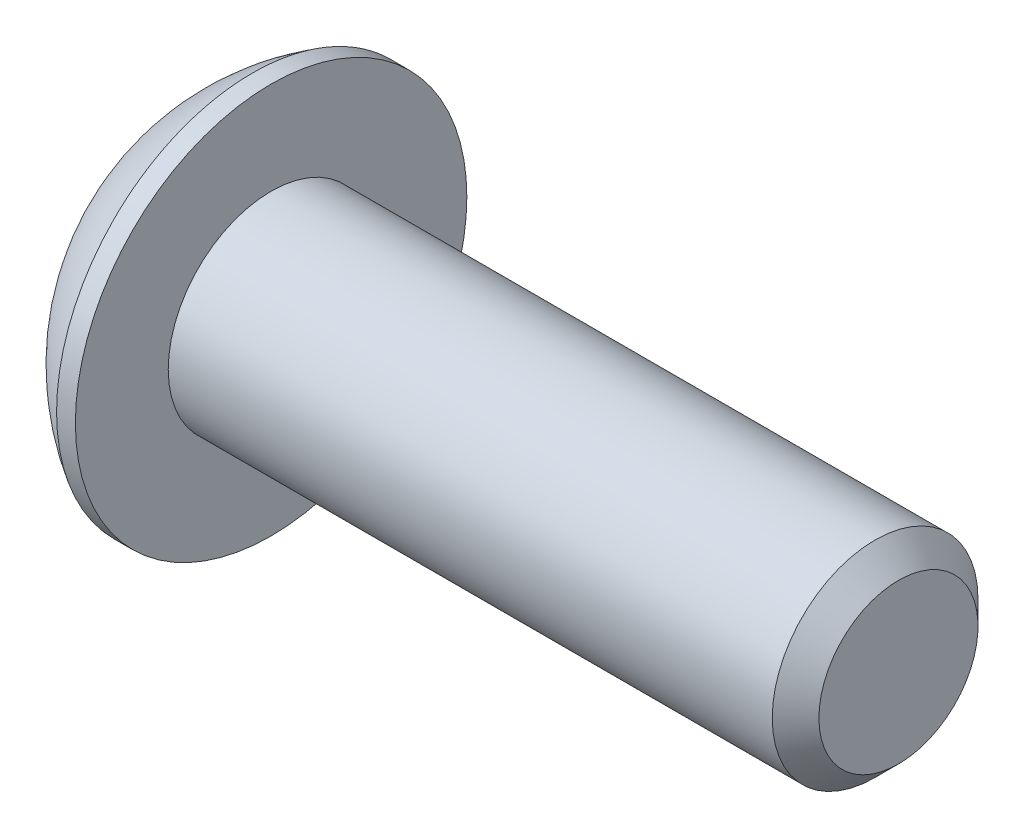
ISO-10303-21;
HEADER;
FILE_DESCRIPTION(('STEP AP214'),'2;1');
FILE_NAME('part.step','',(''),(''),'','','');
FILE_SCHEMA(('AUTOMOTIVE_DESIGN { 1 0 10303 214 1 1 1 1 }'));
ENDSEC;
DATA;
#1=APPLICATION_CONTEXT('core data for automotive mechanical design processes');
#2=APPLICATION_PROTOCOL_DEFINITION('international standard','automotive_design',2000,#1);
#3=PRODUCT_CONTEXT('',#1,'mechanical');
#4=PRODUCT('Part','Part','',(#3));
#5=PRODUCT_RELATED_PRODUCT_CATEGORY('part','',(#4));
#6=PRODUCT_DEFINITION_FORMATION('','',#4);
#7=PRODUCT_DEFINITION_CONTEXT('part definition',#1,'design');
#8=PRODUCT_DEFINITION('design','',#6,#7);
#9=PRODUCT_DEFINITION_SHAPE('','',#8);
#10=(LENGTH_UNIT() NAMED_UNIT(*) SI_UNIT(.MILLI.,.METRE.));
#11=(NAMED_UNIT(*) PLANE_ANGLE_UNIT() SI_UNIT($,.RADIAN.));
#12=(NAMED_UNIT(*) SI_UNIT($,.STERADIAN.) SOLID_ANGLE_UNIT());
#13=UNCERTAINTY_MEASURE_WITH_UNIT(LENGTH_MEASURE(1.E-05),#10,'distance_accuracy_value','');
#14=(GEOMETRIC_REPRESENTATION_CONTEXT(3) GLOBAL_UNCERTAINTY_ASSIGNED_CONTEXT((#13)) GLOBAL_UNIT_ASSIGNED_CONTEXT((#10,
#11,#12)) REPRESENTATION_CONTEXT('',''));
#15=CARTESIAN_POINT('',(0.,0.,0.));
#16=DIRECTION('',(0.,0.,1.));
#17=DIRECTION('',(1.,0.,0.));
#18=AXIS2_PLACEMENT_3D('',#15,#16,#17);
#19=CARTESIAN_POINT('',(1.32080000000034,0.,0.));
#20=DIRECTION('',(-1.,0.,0.));
#21=DIRECTION('',(0.,0.,1.));
#22=AXIS2_PLACEMENT_3D('',#19,#20,#21);
#23=CONICAL_SURFACE('',#22,1.1937999999998,1.04719755119608);
#24=CARTESIAN_POINT('',(2.01004075135902,0.,4.44089209850063E-13));
#25=VERTEX_POINT('',#24);
#26=VERTEX_LOOP('',#25);
#27=FACE_BOUND('',#26,.T.);
#28=CARTESIAN_POINT('',(1.32080000000009,0.,0.));
#29=DIRECTION('',(-1.,0.,0.));
#30=DIRECTION('',(0.,0.,1.));
#31=AXIS2_PLACEMENT_3D('',#28,#29,#30);
#32=CIRCLE('',#31,1.19380000000024);
#33=CARTESIAN_POINT('',(1.32080000000004,-1.03386112703797,0.59690000000006));
#34=VERTEX_POINT('',#33);
#35=CARTESIAN_POINT('',(1.32080000000004,0.,1.19380000000012));
#36=VERTEX_POINT('',#35);
#37=EDGE_CURVE('E18',#34,#36,#32,.T.);
#38=ORIENTED_EDGE('',*,*,#37,.T.);
#39=CARTESIAN_POINT('',(1.32080000000009,0.,0.));
#40=DIRECTION('',(-1.,0.,0.));
#41=DIRECTION('',(0.,0.,1.));
#42=AXIS2_PLACEMENT_3D('',#39,#40,#41);
#43=CIRCLE('',#42,1.19380000000024);
#44=CARTESIAN_POINT('',(1.32080000000004,1.03386112703797,0.596900000000061));
#45=VERTEX_POINT('',#44);
#46=EDGE_CURVE('E146',#36,#45,#43,.T.);
#47=ORIENTED_EDGE('',*,*,#46,.T.);
#48=CARTESIAN_POINT('',(1.32080000000009,0.,0.));
#49=DIRECTION('',(-1.,0.,0.));
#50=DIRECTION('',(0.,0.,1.));
#51=AXIS2_PLACEMENT_3D('',#48,#49,#50);
#52=CIRCLE('',#51,1.19380000000024);
#53=CARTESIAN_POINT('',(1.32080000000004,1.03386112703797,-0.596900000000061));
#54=VERTEX_POINT('',#53);
#55=EDGE_CURVE('E474',#45,#54,#52,.T.);
#56=ORIENTED_EDGE('',*,*,#55,.T.);
#57=CARTESIAN_POINT('',(1.32080000000009,0.,0.));
#58=DIRECTION('',(-1.,0.,0.));
#59=DIRECTION('',(0.,0.,1.));
#60=AXIS2_PLACEMENT_3D('',#57,#58,#59);
#61=CIRCLE('',#60,1.19380000000024);
#62=CARTESIAN_POINT('',(1.32080000000004,1.49457637585666E-12,-1.19380000000012));
#63=VERTEX_POINT('',#62);
#64=EDGE_CURVE('E475',#54,#63,#61,.T.);
#65=ORIENTED_EDGE('',*,*,#64,.T.);
#66=CARTESIAN_POINT('',(1.32080000000009,0.,0.));
#67=DIRECTION('',(-1.,0.,0.));
#68=DIRECTION('',(0.,0.,1.));
#69=AXIS2_PLACEMENT_3D('',#66,#67,#68);
#70=CIRCLE('',#69,1.19380000000024);
#71=CARTESIAN_POINT('',(1.32080000000004,-1.03386112703797,-0.59690000000006));
#72=VERTEX_POINT('',#71);
#73=EDGE_CURVE('E91',#63,#72,#70,.T.);
#74=ORIENTED_EDGE('',*,*,#73,.T.);
#75=CARTESIAN_POINT('',(1.32080000000009,0.,0.));
#76=DIRECTION('',(-1.,0.,0.));
#77=DIRECTION('',(0.,0.,1.));
#78=AXIS2_PLACEMENT_3D('',#75,#76,#77);
#79=CIRCLE('',#78,1.19380000000024);
#80=EDGE_CURVE('E87',#72,#34,#79,.T.);
#81=ORIENTED_EDGE('',*,*,#80,.T.);
#82=EDGE_LOOP('',(#38,#47,#56,#65,#74,#81));
#83=FACE_BOUND('',#82,.T.);
#84=ADVANCED_FACE('F15',(#27,#83),#23,.F.);
#85=CARTESIAN_POINT('',(1.3208,-2.06772225407572,-1.1938));
#86=DIRECTION('',(1.,0.,0.));
#87=DIRECTION('',(0.,0.,-1.));
#88=AXIS2_PLACEMENT_3D('',#85,#86,#87);
#89=PLANE('',#88);
#90=DIRECTION('',(0.,0.5,0.866025403784439));
#91=VECTOR('',#90,1.);
#92=CARTESIAN_POINT('',(1.3208,-1.37848150271715,0.));
#93=LINE('',#92,#91);
#94=CARTESIAN_POINT('',(1.3208,-0.689240751358574,1.1938));
#95=VERTEX_POINT('',#94);
#96=EDGE_CURVE('E99',#95,#34,#93,.F.);
#97=ORIENTED_EDGE('',*,*,#96,.F.);
#98=DIRECTION('',(0.,1.,0.));
#99=VECTOR('',#98,1.);
#100=CARTESIAN_POINT('',(1.3208,-0.689240751358574,1.1938));
#101=LINE('',#100,#99);
#102=EDGE_CURVE('E101',#36,#95,#101,.F.);
#103=ORIENTED_EDGE('',*,*,#102,.F.);
#104=ORIENTED_EDGE('',*,*,#37,.F.);
#105=EDGE_LOOP('',(#97,#103,#104));
#106=FACE_BOUND('',#105,.T.);
#107=ADVANCED_FACE('F97',(#106),#89,.F.);
#108=CARTESIAN_POINT('',(1.3208,-2.06772225407572,-1.1938));
#109=DIRECTION('',(1.,0.,0.));
#110=DIRECTION('',(0.,0.,-1.));
#111=AXIS2_PLACEMENT_3D('',#108,#109,#110);
#112=PLANE('',#111);
#113=DIRECTION('',(0.,-0.5,0.866025403784439));
#114=VECTOR('',#113,1.);
#115=CARTESIAN_POINT('',(1.3208,-0.689240751358574,-1.1938));
#116=LINE('',#115,#114);
#117=CARTESIAN_POINT('',(1.3208,-1.37848150271715,0.));
#118=VERTEX_POINT('',#117);
#119=EDGE_CURVE('E107',#118,#72,#116,.F.);
#120=ORIENTED_EDGE('',*,*,#119,.F.);
#121=DIRECTION('',(0.,0.5,0.866025403784439));
#122=VECTOR('',#121,1.);
#123=CARTESIAN_POINT('',(1.3208,-1.37848150271715,0.));
#124=LINE('',#123,#122);
#125=EDGE_CURVE('E104',#34,#118,#124,.F.);
#126=ORIENTED_EDGE('',*,*,#125,.F.);
#127=ORIENTED_EDGE('',*,*,#80,.F.);
#128=EDGE_LOOP('',(#120,#126,#127));
#129=FACE_BOUND('',#128,.T.);
#130=ADVANCED_FACE('F105',(#129),#112,.F.);
#131=CARTESIAN_POINT('',(1.3208,-2.06772225407572,-1.1938));
#132=DIRECTION('',(1.,0.,0.));
#133=DIRECTION('',(0.,0.,-1.));
#134=AXIS2_PLACEMENT_3D('',#131,#132,#133);
#135=PLANE('',#134);
#136=DIRECTION('',(0.,1.,0.));
#137=VECTOR('',#136,1.);
#138=CARTESIAN_POINT('',(1.3208,0.689240751358577,-1.1938));
#139=LINE('',#138,#137);
#140=CARTESIAN_POINT('',(1.3208,-0.689240751358574,-1.1938));
#141=VERTEX_POINT('',#140);
#142=EDGE_CURVE('E445',#141,#63,#139,.T.);
#143=ORIENTED_EDGE('',*,*,#142,.F.);
#144=DIRECTION('',(0.,-0.5,0.866025403784439));
#145=VECTOR('',#144,1.);
#146=CARTESIAN_POINT('',(1.3208,-0.689240751358574,-1.1938));
#147=LINE('',#146,#145);
#148=EDGE_CURVE('E457',#72,#141,#147,.F.);
#149=ORIENTED_EDGE('',*,*,#148,.F.);
#150=ORIENTED_EDGE('',*,*,#73,.F.);
#151=EDGE_LOOP('',(#143,#149,#150));
#152=FACE_BOUND('',#151,.T.);
#153=ADVANCED_FACE('F189',(#152),#135,.F.);
#154=CARTESIAN_POINT('',(1.3208,-2.06772225407572,-1.1938));
#155=DIRECTION('',(1.,0.,0.));
#156=DIRECTION('',(0.,0.,-1.));
#157=AXIS2_PLACEMENT_3D('',#154,#155,#156);
#158=PLANE('',#157);
#159=DIRECTION('',(0.,-0.5,-0.866025403784439));
#160=VECTOR('',#159,1.);
#161=CARTESIAN_POINT('',(1.3208,1.37848150271715,0.));
#162=LINE('',#161,#160);
#163=CARTESIAN_POINT('',(1.3208,0.689240751358577,-1.1938));
#164=VERTEX_POINT('',#163);
#165=EDGE_CURVE('E431',#164,#54,#162,.F.);
#166=ORIENTED_EDGE('',*,*,#165,.F.);
#167=DIRECTION('',(0.,1.,0.));
#168=VECTOR('',#167,1.);
#169=CARTESIAN_POINT('',(1.3208,0.689240751358577,-1.1938));
#170=LINE('',#169,#168);
#171=EDGE_CURVE('E442',#63,#164,#170,.T.);
#172=ORIENTED_EDGE('',*,*,#171,.F.);
#173=ORIENTED_EDGE('',*,*,#64,.F.);
#174=EDGE_LOOP('',(#166,#172,#173));
#175=FACE_BOUND('',#174,.T.);
#176=ADVANCED_FACE('F185',(#175),#158,.F.);
#177=CARTESIAN_POINT('',(1.3208,-2.06772225407572,-1.1938));
#178=DIRECTION('',(1.,0.,0.));
#179=DIRECTION('',(0.,0.,-1.));
#180=AXIS2_PLACEMENT_3D('',#177,#178,#179);
#181=PLANE('',#180);
#182=DIRECTION('',(0.,0.5,-0.866025403784439));
#183=VECTOR('',#182,1.);
#184=CARTESIAN_POINT('',(1.3208,0.689240751358576,1.1938));
#185=LINE('',#184,#183);
#186=CARTESIAN_POINT('',(1.3208,1.37848150271715,0.));
#187=VERTEX_POINT('',#186);
#188=EDGE_CURVE('E410',#187,#45,#185,.F.);
#189=ORIENTED_EDGE('',*,*,#188,.F.);
#190=DIRECTION('',(0.,-0.5,-0.866025403784439));
#191=VECTOR('',#190,1.);
#192=CARTESIAN_POINT('',(1.3208,1.37848150271715,0.));
#193=LINE('',#192,#191);
#194=EDGE_CURVE('E429',#54,#187,#193,.F.);
#195=ORIENTED_EDGE('',*,*,#194,.F.);
#196=ORIENTED_EDGE('',*,*,#55,.F.);
#197=EDGE_LOOP('',(#189,#195,#196));
#198=FACE_BOUND('',#197,.T.);
#199=ADVANCED_FACE('F181',(#198),#181,.F.);
#200=CARTESIAN_POINT('',(1.3208,-2.06772225407572,-1.1938));
#201=DIRECTION('',(1.,0.,0.));
#202=DIRECTION('',(0.,0.,-1.));
#203=AXIS2_PLACEMENT_3D('',#200,#201,#202);
#204=PLANE('',#203);
#205=DIRECTION('',(0.,1.,0.));
#206=VECTOR('',#205,1.);
#207=CARTESIAN_POINT('',(1.3208,-0.689240751358574,1.1938));
#208=LINE('',#207,#206);
#209=CARTESIAN_POINT('',(1.3208,0.689240751358576,1.1938));
#210=VERTEX_POINT('',#209);
#211=EDGE_CURVE('E116',#210,#36,#208,.F.);
#212=ORIENTED_EDGE('',*,*,#211,.F.);
#213=DIRECTION('',(0.,0.5,-0.866025403784439));
#214=VECTOR('',#213,1.);
#215=CARTESIAN_POINT('',(1.3208,0.689240751358576,1.1938));
#216=LINE('',#215,#214);
#217=EDGE_CURVE('E413',#45,#210,#216,.F.);
#218=ORIENTED_EDGE('',*,*,#217,.F.);
#219=ORIENTED_EDGE('',*,*,#46,.F.);
#220=EDGE_LOOP('',(#212,#218,#219));
#221=FACE_BOUND('',#220,.T.);
#222=ADVANCED_FACE('F177',(#221),#204,.F.);
#223=CARTESIAN_POINT('',(1.3208,-0.689240751358574,1.1938));
#224=DIRECTION('',(0.,0.,-1.));
#225=DIRECTION('',(0.,1.,0.));
#226=AXIS2_PLACEMENT_3D('',#223,#224,#225);
#227=PLANE('',#226);
#228=DIRECTION('',(0.,1.,0.));
#229=VECTOR('',#228,1.);
#230=CARTESIAN_POINT('',(0.,0.,1.1938));
#231=LINE('',#230,#229);
#232=CARTESIAN_POINT('',(0.,0.689240751358577,1.1938));
#233=VERTEX_POINT('',#232);
#234=CARTESIAN_POINT('',(0.,-0.689240751358574,1.1938));
#235=VERTEX_POINT('',#234);
#236=EDGE_CURVE('E407',#233,#235,#231,.F.);
#237=ORIENTED_EDGE('',*,*,#236,.F.);
#238=DIRECTION('',(1.,0.,0.));
#239=VECTOR('',#238,1.);
#240=CARTESIAN_POINT('',(1.3208,0.689240751358576,1.1938));
#241=LINE('',#240,#239);
#242=EDGE_CURVE('E419',#210,#233,#241,.F.);
#243=ORIENTED_EDGE('',*,*,#242,.F.);
#244=ORIENTED_EDGE('',*,*,#211,.T.);
#245=ORIENTED_EDGE('',*,*,#102,.T.);
#246=DIRECTION('',(1.,0.,0.));
#247=VECTOR('',#246,1.);
#248=CARTESIAN_POINT('',(1.3208,-0.689240751358574,1.1938));
#249=LINE('',#248,#247);
#250=EDGE_CURVE('E110',#235,#95,#249,.T.);
#251=ORIENTED_EDGE('',*,*,#250,.F.);
#252=EDGE_LOOP('',(#237,#243,#244,#245,#251));
#253=FACE_BOUND('',#252,.T.);
#254=ADVANCED_FACE('F174',(#253),#227,.T.);
#255=CARTESIAN_POINT('',(1.3208,-1.37848150271715,0.));
#256=DIRECTION('',(0.,0.866025403784439,-0.5));
#257=DIRECTION('',(0.,0.5,0.866025403784439));
#258=AXIS2_PLACEMENT_3D('',#255,#256,#257);
#259=PLANE('',#258);
#260=DIRECTION('',(0.,-0.5,-0.866025403784439));
#261=VECTOR('',#260,1.);
#262=CARTESIAN_POINT('',(0.,-0.689240751358574,1.1938));
#263=LINE('',#262,#261);
#264=CARTESIAN_POINT('',(0.,-1.37848150271715,0.));
#265=VERTEX_POINT('',#264);
#266=EDGE_CURVE('E404',#235,#265,#263,.T.);
#267=ORIENTED_EDGE('',*,*,#266,.F.);
#268=ORIENTED_EDGE('',*,*,#250,.T.);
#269=ORIENTED_EDGE('',*,*,#96,.T.);
#270=ORIENTED_EDGE('',*,*,#125,.T.);
#271=DIRECTION('',(1.,0.,0.));
#272=VECTOR('',#271,1.);
#273=CARTESIAN_POINT('',(1.3208,-1.37848150271715,0.));
#274=LINE('',#273,#272);
#275=EDGE_CURVE('E454',#265,#118,#274,.T.);
#276=ORIENTED_EDGE('',*,*,#275,.F.);
#277=EDGE_LOOP('',(#267,#268,#269,#270,#276));
#278=FACE_BOUND('',#277,.T.);
#279=ADVANCED_FACE('F114',(#278),#259,.T.);
#280=CARTESIAN_POINT('',(1.3208,-0.689240751358574,-1.1938));
#281=DIRECTION('',(0.,0.866025403784439,0.5));
#282=DIRECTION('',(0.,-0.5,0.866025403784439));
#283=AXIS2_PLACEMENT_3D('',#280,#281,#282);
#284=PLANE('',#283);
#285=DIRECTION('',(0.,0.5,-0.866025403784439));
#286=VECTOR('',#285,1.);
#287=CARTESIAN_POINT('',(0.,-1.37848150271715,0.));
#288=LINE('',#287,#286);
#289=CARTESIAN_POINT('',(0.,-0.689240751358574,-1.1938));
#290=VERTEX_POINT('',#289);
#291=EDGE_CURVE('E401',#265,#290,#288,.T.);
#292=ORIENTED_EDGE('',*,*,#291,.F.);
#293=ORIENTED_EDGE('',*,*,#275,.T.);
#294=ORIENTED_EDGE('',*,*,#119,.T.);
#295=ORIENTED_EDGE('',*,*,#148,.T.);
#296=DIRECTION('',(1.,0.,0.));
#297=VECTOR('',#296,1.);
#298=CARTESIAN_POINT('',(1.3208,-0.689240751358574,-1.1938));
#299=LINE('',#298,#297);
#300=EDGE_CURVE('E439',#290,#141,#299,.T.);
#301=ORIENTED_EDGE('',*,*,#300,.F.);
#302=EDGE_LOOP('',(#292,#293,#294,#295,#301));
#303=FACE_BOUND('',#302,.T.);
#304=ADVANCED_FACE('F167',(#303),#284,.T.);
#305=CARTESIAN_POINT('',(1.3208,0.689240751358577,-1.1938));
#306=DIRECTION('',(0.,0.,1.));
#307=DIRECTION('',(1.,0.,0.));
#308=AXIS2_PLACEMENT_3D('',#305,#306,#307);
#309=PLANE('',#308);
#310=DIRECTION('',(0.,1.,0.));
#311=VECTOR('',#310,1.);
#312=CARTESIAN_POINT('',(0.,0.,-1.1938));
#313=LINE('',#312,#311);
#314=CARTESIAN_POINT('',(0.,0.689240751358577,-1.1938));
#315=VERTEX_POINT('',#314);
#316=EDGE_CURVE('E398',#290,#315,#313,.T.);
#317=ORIENTED_EDGE('',*,*,#316,.F.);
#318=ORIENTED_EDGE('',*,*,#300,.T.);
#319=ORIENTED_EDGE('',*,*,#142,.T.);
#320=ORIENTED_EDGE('',*,*,#171,.T.);
#321=DIRECTION('',(1.,0.,0.));
#322=VECTOR('',#321,1.);
#323=CARTESIAN_POINT('',(1.3208,0.689240751358577,-1.1938));
#324=LINE('',#323,#322);
#325=EDGE_CURVE('E414',#315,#164,#324,.T.);
#326=ORIENTED_EDGE('',*,*,#325,.F.);
#327=EDGE_LOOP('',(#317,#318,#319,#320,#326));
#328=FACE_BOUND('',#327,.T.);
#329=ADVANCED_FACE('F164',(#328),#309,.T.);
#330=CARTESIAN_POINT('',(1.3208,1.37848150271715,0.));
#331=DIRECTION('',(0.,-0.866025403784439,0.5));
#332=DIRECTION('',(0.,-0.5,-0.866025403784439));
#333=AXIS2_PLACEMENT_3D('',#330,#331,#332);
#334=PLANE('',#333);
#335=DIRECTION('',(0.,0.5,0.866025403784439));
#336=VECTOR('',#335,1.);
#337=CARTESIAN_POINT('',(0.,0.689240751358577,-1.1938));
#338=LINE('',#337,#336);
#339=CARTESIAN_POINT('',(0.,1.37848150271715,0.));
#340=VERTEX_POINT('',#339);
#341=EDGE_CURVE('E395',#315,#340,#338,.T.);
#342=ORIENTED_EDGE('',*,*,#341,.F.);
#343=ORIENTED_EDGE('',*,*,#325,.T.);
#344=ORIENTED_EDGE('',*,*,#165,.T.);
#345=ORIENTED_EDGE('',*,*,#194,.T.);
#346=DIRECTION('',(1.,0.,0.));
#347=VECTOR('',#346,1.);
#348=CARTESIAN_POINT('',(1.3208,1.37848150271715,0.));
#349=LINE('',#348,#347);
#350=EDGE_CURVE('E33',#340,#187,#349,.T.);
#351=ORIENTED_EDGE('',*,*,#350,.F.);
#352=EDGE_LOOP('',(#342,#343,#344,#345,#351));
#353=FACE_BOUND('',#352,.T.);
#354=ADVANCED_FACE('F160',(#353),#334,.T.);
#355=CARTESIAN_POINT('',(1.3208,0.689240751358576,1.1938));
#356=DIRECTION('',(0.,-0.866025403784439,-0.5));
#357=DIRECTION('',(0.,0.5,-0.866025403784439));
#358=AXIS2_PLACEMENT_3D('',#355,#356,#357);
#359=PLANE('',#358);
#360=DIRECTION('',(0.,-0.5,0.866025403784439));
#361=VECTOR('',#360,1.);
#362=CARTESIAN_POINT('',(0.,1.37848150271715,0.));
#363=LINE('',#362,#361);
#364=EDGE_CURVE('E145',#340,#233,#363,.T.);
#365=ORIENTED_EDGE('',*,*,#364,.F.);
#366=ORIENTED_EDGE('',*,*,#350,.T.);
#367=ORIENTED_EDGE('',*,*,#188,.T.);
#368=ORIENTED_EDGE('',*,*,#217,.T.);
#369=ORIENTED_EDGE('',*,*,#242,.T.);
#370=EDGE_LOOP('',(#365,#366,#367,#368,#369));
#371=FACE_BOUND('',#370,.T.);
#372=ADVANCED_FACE('F156',(#371),#359,.T.);
#373=CARTESIAN_POINT('',(0.,0.,0.));
#374=DIRECTION('',(-1.,0.,0.));
#375=DIRECTION('',(0.,0.,1.));
#376=AXIS2_PLACEMENT_3D('',#373,#374,#375);
#377=PLANE('',#376);
#378=ORIENTED_EDGE('',*,*,#341,.T.);
#379=ORIENTED_EDGE('',*,*,#364,.T.);
#380=ORIENTED_EDGE('',*,*,#236,.T.);
#381=ORIENTED_EDGE('',*,*,#266,.T.);
#382=ORIENTED_EDGE('',*,*,#291,.T.);
#383=ORIENTED_EDGE('',*,*,#316,.T.);
#384=EDGE_LOOP('',(#378,#379,#380,#381,#382,#383));
#385=FACE_BOUND('',#384,.T.);
#386=CARTESIAN_POINT('',(0.,1.9812,0.));
#387=CARTESIAN_POINT('',(0.,1.9811996664299,0.0556258831179428));
#388=CARTESIAN_POINT('',(0.,1.97885520380442,0.111261989398606));
#389=CARTESIAN_POINT('',(0.,1.96949260169541,0.222149719830458));
#390=CARTESIAN_POINT('',(0.,1.96247308239605,0.277401225602895));
#391=CARTESIAN_POINT('',(0.,1.94379192841038,0.387209508139747));
#392=CARTESIAN_POINT('',(-1.85325793235264E-13,1.93212292489526,0.441765039546365));
#393=CARTESIAN_POINT('',(1.86344214223505E-13,1.90422331175315,0.549729449347493));
#394=CARTESIAN_POINT('',(6.94543371897454E-13,1.88798900035338,0.603137359208869));
#395=CARTESIAN_POINT('',(1.15501975216981E-12,1.83266214476501,0.760839131321828));
#396=CARTESIAN_POINT('',(0.,1.78690023648845,0.862876433575429));
#397=CARTESIAN_POINT('',(0.,1.67887358150667,1.05780719540872));
#398=CARTESIAN_POINT('',(9.54193214892627E-13,1.6166082074585,1.15070030720801));
#399=CARTESIAN_POINT('',(5.94805591894675E-13,1.51224157140982,1.28116890915697));
#400=CARTESIAN_POINT('',(1.63221293851378E-13,1.4755970394354,1.32320451127026));
#401=CARTESIAN_POINT('',(-1.62196980336157E-13,1.39893832619713,1.40400288695709));
#402=CARTESIAN_POINT('',(0.,1.35892742784698,1.44276877695455));
#403=CARTESIAN_POINT('',(1.14362537325405E-13,1.23416504602197,1.55382272417904));
#404=CARTESIAN_POINT('',(0.,1.14466125559859,1.62089527952111));
#405=CARTESIAN_POINT('',(0.,0.955712144178167,1.7390221808118));
#406=CARTESIAN_POINT('',(0.,0.856267198233564,1.79007713076007));
#407=CARTESIAN_POINT('',(0.,0.650206345910843,1.87477637530954));
#408=CARTESIAN_POINT('',(0.,0.543590516134855,1.90842085586267));
#409=CARTESIAN_POINT('',(0.,0.326226155292018,1.95733039300656));
#410=CARTESIAN_POINT('',(0.,0.21547760215793,1.97259535144288));
#411=CARTESIAN_POINT('',(0.,-0.00701040587544639,1.98431697865418));
#412=CARTESIAN_POINT('',(0.,-0.118749860774734,1.98077364742917));
#413=CARTESIAN_POINT('',(0.,-0.340050178355485,1.95497485623825));
#414=CARTESIAN_POINT('',(0.,-0.449611052668255,1.93271949620218));
#415=CARTESIAN_POINT('',(0.,-0.663431110729174,1.87014138774523));
#416=CARTESIAN_POINT('',(0.,-0.76769023783852,1.82981844635272));
#417=CARTESIAN_POINT('',(0.,-0.968005760719347,1.73219968377096));
#418=CARTESIAN_POINT('',(0.,-1.0640618469811,1.6749032225164));
#419=CARTESIAN_POINT('',(0.,-1.19980276751283,1.57757371205873));
#420=CARTESIAN_POINT('',(0.,-1.24366557129213,1.54322665019466));
#421=CARTESIAN_POINT('',(0.,-1.32838995706696,1.47093063174264));
#422=CARTESIAN_POINT('',(0.,-1.36924860178706,1.43297823102439));
#423=CARTESIAN_POINT('',(0.,-1.48674671849223,1.31419842051173));
#424=CARTESIAN_POINT('',(0.,-1.55842832343237,1.22836221289311));
#425=CARTESIAN_POINT('',(0.,-1.6863396856475,1.04586168272493));
#426=CARTESIAN_POINT('',(0.,-1.7425700302488,0.949197771949774));
#427=CARTESIAN_POINT('',(0.,-1.8141614250401,0.798182600298684));
#428=CARTESIAN_POINT('',(0.,-1.83591780585875,0.746776203847791));
#429=CARTESIAN_POINT('',(0.,-1.87500754181092,0.642341081688636));
#430=CARTESIAN_POINT('',(0.,-1.89234447645404,0.589313708122847));
#431=CARTESIAN_POINT('',(0.,-1.92246053433554,0.482076273028395));
#432=CARTESIAN_POINT('',(0.,-1.93524685475118,0.42786822425751));
#433=CARTESIAN_POINT('',(0.,-1.95620937250494,0.318578151844611));
#434=CARTESIAN_POINT('',(0.,-1.96438692958147,0.263496390912872));
#435=CARTESIAN_POINT('',(0.,-1.97388528284653,0.173607715038558));
#436=CARTESIAN_POINT('',(0.,-1.97662743364426,0.138944718024998));
#437=CARTESIAN_POINT('',(0.,-1.98028489645283,0.0695224782567002));
#438=CARTESIAN_POINT('',(0.,-1.98120020846367,0.0347632355019631));
#439=CARTESIAN_POINT('',(0.,-1.9811996664299,-0.0556258831179437));
#440=CARTESIAN_POINT('',(0.,-1.97885520380442,-0.111261989398607));
#441=CARTESIAN_POINT('',(0.,-1.96949260169541,-0.222149719830459));
#442=CARTESIAN_POINT('',(0.,-1.96247308239605,-0.277401225602897));
#443=CARTESIAN_POINT('',(0.,-1.94379192841039,-0.387209508139749));
#444=CARTESIAN_POINT('',(-1.85269749640691E-13,-1.93212292489526,-0.441765039546367));
#445=CARTESIAN_POINT('',(1.86288125054388E-13,-1.90422331175315,-0.549729449347495));
#446=CARTESIAN_POINT('',(6.94525090263764E-13,-1.88798900035338,-0.603137359208872));
#447=CARTESIAN_POINT('',(1.15505622829081E-12,-1.83266214476501,-0.760839131321831));
#448=CARTESIAN_POINT('',(0.,-1.78690023648845,-0.862876433575431));
#449=CARTESIAN_POINT('',(0.,-1.67887358150667,-1.05780719540872));
#450=CARTESIAN_POINT('',(9.54248812869379E-13,-1.6166082074585,-1.15070030720801));
#451=CARTESIAN_POINT('',(5.94777756479239E-13,-1.51224157140982,-1.28116890915698));
#452=CARTESIAN_POINT('',(1.63138949183833E-13,-1.47559703943539,-1.32320451127027));
#453=CARTESIAN_POINT('',(-1.62114715061273E-13,-1.39893832619713,-1.40400288695709));
#454=CARTESIAN_POINT('',(0.,-1.35892742784699,-1.44276877695455));
#455=CARTESIAN_POINT('',(1.13760489124207E-13,-1.23416504602197,-1.55382272417904));
#456=CARTESIAN_POINT('',(0.,-1.14466125559859,-1.62089527952111));
#457=CARTESIAN_POINT('',(0.,-0.95571214417816,-1.73902218081179));
#458=CARTESIAN_POINT('',(0.,-0.856267198233559,-1.79007713076007));
#459=CARTESIAN_POINT('',(0.,-0.650206345910841,-1.87477637530954));
#460=CARTESIAN_POINT('',(0.,-0.543590516134854,-1.90842085586267));
#461=CARTESIAN_POINT('',(0.,-0.326226155292018,-1.95733039300657));
#462=CARTESIAN_POINT('',(0.,-0.215477602157929,-1.97259535144288));
#463=CARTESIAN_POINT('',(0.,0.0070104058754487,-1.98431697865418));
#464=CARTESIAN_POINT('',(0.,0.118749860774737,-1.98077364742916));
#465=CARTESIAN_POINT('',(0.,0.340050178355489,-1.95497485623824));
#466=CARTESIAN_POINT('',(0.,0.44961105266826,-1.93271949620218));
#467=CARTESIAN_POINT('',(0.,0.663431110729178,-1.87014138774524));
#468=CARTESIAN_POINT('',(0.,0.767690237838524,-1.82981844635272));
#469=CARTESIAN_POINT('',(0.,0.968005760719348,-1.73219968377096));
#470=CARTESIAN_POINT('',(0.,1.0640618469811,-1.67490322251639));
#471=CARTESIAN_POINT('',(0.,1.19980276751283,-1.57757371205873));
#472=CARTESIAN_POINT('',(0.,1.24366557129214,-1.54322665019465));
#473=CARTESIAN_POINT('',(0.,1.32838995706696,-1.47093063174263));
#474=CARTESIAN_POINT('',(0.,1.36924860178706,-1.43297823102439));
#475=CARTESIAN_POINT('',(0.,1.48674671849223,-1.31419842051172));
#476=CARTESIAN_POINT('',(0.,1.55842832343237,-1.22836221289311));
#477=CARTESIAN_POINT('',(0.,1.6863396856475,-1.04586168272492));
#478=CARTESIAN_POINT('',(0.,1.7425700302488,-0.949197771949768));
#479=CARTESIAN_POINT('',(0.,1.8141614250401,-0.798182600298677));
#480=CARTESIAN_POINT('',(0.,1.83591780585875,-0.746776203847785));
#481=CARTESIAN_POINT('',(0.,1.87500754181092,-0.64234108168863));
#482=CARTESIAN_POINT('',(0.,1.89234447645404,-0.589313708122841));
#483=CARTESIAN_POINT('',(0.,1.92246053433555,-0.482076273028389));
#484=CARTESIAN_POINT('',(0.,1.93524685475118,-0.427868224257505));
#485=CARTESIAN_POINT('',(0.,1.95620937250494,-0.318578151844605));
#486=CARTESIAN_POINT('',(0.,1.96438692958147,-0.263496390912866));
#487=CARTESIAN_POINT('',(0.,1.97388528284653,-0.173607715038553));
#488=CARTESIAN_POINT('',(0.,1.97662743364426,-0.138944718024994));
#489=CARTESIAN_POINT('',(0.,1.98028489645283,-0.0695224782566989));
#490=CARTESIAN_POINT('',(0.,1.98120020846367,-0.034763235501963));
#491=CARTESIAN_POINT('',(0.,1.9812,0.));
#492=B_SPLINE_CURVE_WITH_KNOTS('',3,(#386,#387,#388,#389,#390,#391,#392,#393,#394,#395,#396,
#397,#398,#399,#400,#401,#402,#403,#404,#405,#406,#407,#408,#409,#410,#411,#412,#413,#414,#415,
#416,#417,#418,#419,#420,#421,#422,#423,#424,#425,#426,#427,#428,#429,#430,#431,#432,#433,#434,
#435,#436,#437,#438,#439,#440,#441,#442,#443,#444,#445,#446,#447,#448,#449,#450,#451,#452,#453,
#454,#455,#456,#457,#458,#459,#460,#461,#462,#463,#464,#465,#466,#467,#468,#469,#470,#471,#472,
#473,#474,#475,#476,#477,#478,#479,#480,#481,#482,#483,#484,#485,#486,#487,#488,#489,#490,#491),
.UNSPECIFIED.,.T.,.F.,(4,2,2,2,2,2,2,2,2,2,2,2,2,2,2,2,2,2,2,2,2,2,2,2,2,2,2,2,2,2,2,2,2,2,2,2,
2,2,2,2,2,2,2,2,2,2,2,2,2,2,2,2,4),(0.,0.166845646007828,0.333740557374255,0.500901034367693,
0.668197445942386,1.00199278686282,1.33580081809885,1.50292354032982,1.6698851310853,
2.00370118900129,2.33750465770544,2.67130456115909,3.005106247238,3.33890793331696,
3.67270783677065,4.00651130547476,4.34032736339026,4.50728895414554,4.67441167637632,
5.00821970761259,5.34201504853332,5.50931146010827,5.67647193710191,5.84336684846844,
6.0102124944764,6.11448220058334,6.21875190669029,6.38559755269812,6.55249246406454,
6.71965294105798,6.88694935263268,7.22074469355311,7.55455272478915,7.72167544702011,
7.88863703777559,8.22245309569158,8.55625656439573,8.89005646784938,9.2238581539283,
9.55765984000725,9.89145974346094,10.2252632121651,10.5590792700806,10.7260408608358,
10.8931635830666,11.2269716143029,11.5607669552236,11.7280633667986,11.8952238437922,
12.0621187551587,12.2289644011667,12.3332341072736,12.4375038133806),.UNSPECIFIED.);
#493=CARTESIAN_POINT('',(0.,1.9812,0.));
#494=VERTEX_POINT('',#493);
#495=EDGE_CURVE('E138',#494,#494,#492,.T.);
#496=ORIENTED_EDGE('',*,*,#495,.F.);
#497=EDGE_LOOP('',(#496));
#498=FACE_BOUND('',#497,.T.);
#499=ADVANCED_FACE('F152',(#385,#498),#377,.T.);
#500=CARTESIAN_POINT('',(4.13385,0.,0.));
#501=DIRECTION('',(0.,1.,0.));
#502=DIRECTION('',(1.,0.,0.));
#503=AXIS2_PLACEMENT_3D('',#500,#501,#502);
#504=SPHERICAL_SURFACE('',#503,4.58408870578439);
#505=CARTESIAN_POINT('',(1.8288,0.,0.));
#506=DIRECTION('',(-1.,0.,0.));
#507=DIRECTION('',(0.,0.,1.));
#508=AXIS2_PLACEMENT_3D('',#505,#506,#507);
#509=CIRCLE('',#508,3.9624);
#510=CARTESIAN_POINT('',(1.8288,0.,3.9624));
#511=VERTEX_POINT('',#510);
#512=EDGE_CURVE('E135',#511,#511,#509,.F.);
#513=ORIENTED_EDGE('',*,*,#512,.F.);
#514=EDGE_LOOP('',(#513));
#515=FACE_BOUND('',#514,.T.);
#516=ORIENTED_EDGE('',*,*,#495,.T.);
#517=EDGE_LOOP('',(#516));
#518=FACE_BOUND('',#517,.T.);
#519=ADVANCED_FACE('F148',(#515,#518),#504,.T.);
#520=CARTESIAN_POINT('',(14.9098,0.,0.));
#521=DIRECTION('',(-1.,0.,0.));
#522=DIRECTION('',(0.,0.,1.));
#523=AXIS2_PLACEMENT_3D('',#520,#521,#522);
#524=PLANE('',#523);
#525=CARTESIAN_POINT('',(14.9098000000549,0.,0.));
#526=DIRECTION('',(-1.,0.,0.));
#527=DIRECTION('',(0.,0.,1.));
#528=AXIS2_PLACEMENT_3D('',#525,#526,#527);
#529=CIRCLE('',#528,1.61035999997239);
#530=CARTESIAN_POINT('',(14.9098000000549,0.,1.61035999997239));
#531=VERTEX_POINT('',#530);
#532=EDGE_CURVE('E132',#531,#531,#529,.T.);
#533=ORIENTED_EDGE('',*,*,#532,.F.);
#534=EDGE_LOOP('',(#533));
#535=FACE_BOUND('',#534,.T.);
#536=ADVANCED_FACE('F219',(#535),#524,.F.);
#537=CARTESIAN_POINT('',(0.,0.,0.));
#538=DIRECTION('',(-1.,0.,0.));
#539=DIRECTION('',(0.,0.,1.));
#540=AXIS2_PLACEMENT_3D('',#537,#538,#539);
#541=CYLINDRICAL_SURFACE('',#540,3.9624);
#542=ORIENTED_EDGE('',*,*,#512,.T.);
#543=EDGE_LOOP('',(#542));
#544=FACE_BOUND('',#543,.T.);
#545=CARTESIAN_POINT('',(2.2098,0.,0.));
#546=DIRECTION('',(-1.,0.,0.));
#547=DIRECTION('',(0.,0.,1.));
#548=AXIS2_PLACEMENT_3D('',#545,#546,#547);
#549=CIRCLE('',#548,3.9624);
#550=CARTESIAN_POINT('',(2.2098,0.,3.9624));
#551=VERTEX_POINT('',#550);
#552=EDGE_CURVE('E129',#551,#551,#549,.T.);
#553=ORIENTED_EDGE('',*,*,#552,.T.);
#554=EDGE_LOOP('',(#553));
#555=FACE_BOUND('',#554,.T.);
#556=ADVANCED_FACE('F216',(#544,#555),#541,.T.);
#557=CARTESIAN_POINT('',(14.4373599999881,0.,0.));
#558=DIRECTION('',(-1.,0.,0.));
#559=DIRECTION('',(0.,0.,1.));
#560=AXIS2_PLACEMENT_3D('',#557,#558,#559);
#561=CONICAL_SURFACE('',#560,2.08280000003924,0.785398163397448);
#562=CARTESIAN_POINT('',(14.43736,0.,0.));
#563=DIRECTION('',(-1.,0.,0.));
#564=DIRECTION('',(0.,0.,1.));
#565=AXIS2_PLACEMENT_3D('',#562,#563,#564);
#566=CIRCLE('',#565,2.0828);
#567=CARTESIAN_POINT('',(14.43736,0.,2.0828));
#568=VERTEX_POINT('',#567);
#569=EDGE_CURVE('E24',#568,#568,#566,.T.);
#570=ORIENTED_EDGE('',*,*,#569,.F.);
#571=EDGE_LOOP('',(#570));
#572=FACE_BOUND('',#571,.T.);
#573=ORIENTED_EDGE('',*,*,#532,.T.);
#574=EDGE_LOOP('',(#573));
#575=FACE_BOUND('',#574,.T.);
#576=ADVANCED_FACE('F209',(#572,#575),#561,.T.);
#577=CARTESIAN_POINT('',(2.2098,2.0828,0.));
#578=DIRECTION('',(-1.,0.,0.));
#579=DIRECTION('',(0.,0.,1.));
#580=AXIS2_PLACEMENT_3D('',#577,#578,#579);
#581=PLANE('',#580);
#582=CARTESIAN_POINT('',(2.2098,0.,0.));
#583=DIRECTION('',(-1.,0.,0.));
#584=DIRECTION('',(0.,0.,1.));
#585=AXIS2_PLACEMENT_3D('',#582,#583,#584);
#586=CIRCLE('',#585,2.0828);
#587=CARTESIAN_POINT('',(2.2098,0.,2.0828));
#588=VERTEX_POINT('',#587);
#589=EDGE_CURVE('E10',#588,#588,#586,.F.);
#590=ORIENTED_EDGE('',*,*,#589,.F.);
#591=EDGE_LOOP('',(#590));
#592=FACE_BOUND('',#591,.T.);
#593=ORIENTED_EDGE('',*,*,#552,.F.);
#594=EDGE_LOOP('',(#593));
#595=FACE_BOUND('',#594,.T.);
#596=ADVANCED_FACE('F203',(#592,#595),#581,.F.);
#597=CARTESIAN_POINT('',(0.,0.,0.));
#598=DIRECTION('',(-1.,0.,0.));
#599=DIRECTION('',(0.,0.,1.));
#600=AXIS2_PLACEMENT_3D('',#597,#598,#599);
#601=CYLINDRICAL_SURFACE('',#600,2.0828);
#602=ORIENTED_EDGE('',*,*,#589,.T.);
#603=EDGE_LOOP('',(#602));
#604=FACE_BOUND('',#603,.T.);
#605=ORIENTED_EDGE('',*,*,#569,.T.);
#606=EDGE_LOOP('',(#605));
#607=FACE_BOUND('',#606,.T.);
#608=ADVANCED_FACE('F201',(#604,#607),#601,.T.);
#609=CLOSED_SHELL('',(#84,#107,#130,#153,#176,#199,#222,#254,#279,#304,#329,#354,#372,#499,#519,
#536,#556,#576,#596,#608));
#610=MANIFOLD_SOLID_BREP('B1',#609);
#611=ADVANCED_BREP_SHAPE_REPRESENTATION('',(#18,#610),#14);
#612=SHAPE_DEFINITION_REPRESENTATION(#9,#611);
ENDSEC;
END-ISO-10303-21;
